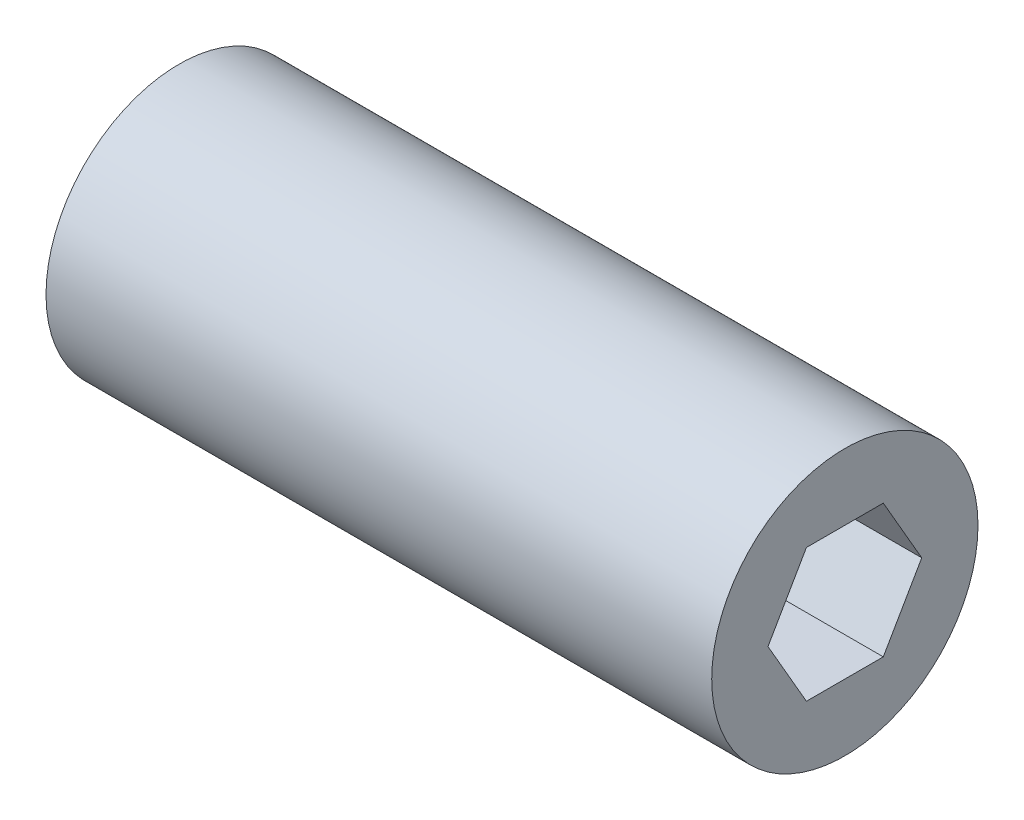
ISO-10303-21;
HEADER;
FILE_DESCRIPTION(('STEP AP214'),'2;1');
FILE_NAME('part.step','',(''),(''),'','','');
FILE_SCHEMA(('AUTOMOTIVE_DESIGN { 1 0 10303 214 1 1 1 1 }'));
ENDSEC;
DATA;
#1=APPLICATION_CONTEXT('core data for automotive mechanical design processes');
#2=APPLICATION_PROTOCOL_DEFINITION('international standard','automotive_design',2000,#1);
#3=PRODUCT_CONTEXT('',#1,'mechanical');
#4=PRODUCT('Part','Part','',(#3));
#5=PRODUCT_RELATED_PRODUCT_CATEGORY('part','',(#4));
#6=PRODUCT_DEFINITION_FORMATION('','',#4);
#7=PRODUCT_DEFINITION_CONTEXT('part definition',#1,'design');
#8=PRODUCT_DEFINITION('design','',#6,#7);
#9=PRODUCT_DEFINITION_SHAPE('','',#8);
#10=(LENGTH_UNIT() NAMED_UNIT(*) SI_UNIT(.MILLI.,.METRE.));
#11=(NAMED_UNIT(*) PLANE_ANGLE_UNIT() SI_UNIT($,.RADIAN.));
#12=(NAMED_UNIT(*) SI_UNIT($,.STERADIAN.) SOLID_ANGLE_UNIT());
#13=UNCERTAINTY_MEASURE_WITH_UNIT(LENGTH_MEASURE(1.E-05),#10,'distance_accuracy_value','');
#14=(GEOMETRIC_REPRESENTATION_CONTEXT(3) GLOBAL_UNCERTAINTY_ASSIGNED_CONTEXT((#13)) GLOBAL_UNIT_ASSIGNED_CONTEXT((#10,
#11,#12)) REPRESENTATION_CONTEXT('',''));
#15=CARTESIAN_POINT('',(0.,0.,0.));
#16=DIRECTION('',(0.,0.,1.));
#17=DIRECTION('',(1.,0.,0.));
#18=AXIS2_PLACEMENT_3D('',#15,#16,#17);
#19=CARTESIAN_POINT('',(8.3,0.,7.));
#20=DIRECTION('',(1.,0.,0.));
#21=DIRECTION('',(0.,0.,-1.));
#22=AXIS2_PLACEMENT_3D('',#19,#20,#21);
#23=PLANE('',#22);
#24=DIRECTION('',(0.,-0.866025404730548,-0.499999998361291));
#25=VECTOR('',#24,1.);
#26=CARTESIAN_POINT('',(8.3,-0.375,7.64951905));
#27=LINE('',#26,#25);
#28=CARTESIAN_POINT('',(8.3,0.,7.8660254));
#29=VERTEX_POINT('',#28);
#30=CARTESIAN_POINT('',(8.3,-0.75,7.4330127));
#31=VERTEX_POINT('',#30);
#32=EDGE_CURVE('E80',#29,#31,#27,.T.);
#33=ORIENTED_EDGE('',*,*,#32,.T.);
#34=DIRECTION('',(0.,0.,-1.));
#35=VECTOR('',#34,1.);
#36=CARTESIAN_POINT('',(8.3,-0.75,7.));
#37=LINE('',#36,#35);
#38=CARTESIAN_POINT('',(8.3,-0.75,6.5669873));
#39=VERTEX_POINT('',#38);
#40=EDGE_CURVE('E64',#31,#39,#37,.T.);
#41=ORIENTED_EDGE('',*,*,#40,.T.);
#42=DIRECTION('',(0.,0.866025404730548,-0.499999998361291));
#43=VECTOR('',#42,1.);
#44=CARTESIAN_POINT('',(8.3,-0.375,6.35048095));
#45=LINE('',#44,#43);
#46=CARTESIAN_POINT('',(8.3,0.,6.1339746));
#47=VERTEX_POINT('',#46);
#48=EDGE_CURVE('E69',#39,#47,#45,.T.);
#49=ORIENTED_EDGE('',*,*,#48,.T.);
#50=DIRECTION('',(0.,0.866025404730548,0.499999998361291));
#51=VECTOR('',#50,1.);
#52=CARTESIAN_POINT('',(8.3,0.375,6.35048095));
#53=LINE('',#52,#51);
#54=CARTESIAN_POINT('',(8.3,0.75,6.5669873));
#55=VERTEX_POINT('',#54);
#56=EDGE_CURVE('E103',#47,#55,#53,.T.);
#57=ORIENTED_EDGE('',*,*,#56,.T.);
#58=DIRECTION('',(0.,0.,1.));
#59=VECTOR('',#58,1.);
#60=CARTESIAN_POINT('',(8.3,0.75,7.));
#61=LINE('',#60,#59);
#62=CARTESIAN_POINT('',(8.3,0.75,7.4330127));
#63=VERTEX_POINT('',#62);
#64=EDGE_CURVE('E98',#55,#63,#61,.T.);
#65=ORIENTED_EDGE('',*,*,#64,.T.);
#66=DIRECTION('',(0.,-0.866025404730548,0.499999998361291));
#67=VECTOR('',#66,1.);
#68=CARTESIAN_POINT('',(8.3,0.375,7.64951905));
#69=LINE('',#68,#67);
#70=EDGE_CURVE('E94',#63,#29,#69,.T.);
#71=ORIENTED_EDGE('',*,*,#70,.T.);
#72=EDGE_LOOP('',(#33,#41,#49,#57,#65,#71));
#73=FACE_BOUND('',#72,.T.);
#74=ADVANCED_FACE('F16',(#73),#23,.T.);
#75=CARTESIAN_POINT('',(10.,-0.375,6.35048095));
#76=DIRECTION('',(0.,-0.499999998361291,-0.866025404730548));
#77=DIRECTION('',(0.,0.866025404730548,-0.499999998361291));
#78=AXIS2_PLACEMENT_3D('',#75,#76,#77);
#79=PLANE('',#78);
#80=DIRECTION('',(1.,0.,0.));
#81=VECTOR('',#80,1.);
#82=CARTESIAN_POINT('',(10.,-0.75,6.5669873));
#83=LINE('',#82,#81);
#84=CARTESIAN_POINT('',(10.,-0.75,6.5669873));
#85=VERTEX_POINT('',#84);
#86=EDGE_CURVE('E71',#39,#85,#83,.T.);
#87=ORIENTED_EDGE('',*,*,#86,.T.);
#88=DIRECTION('',(0.,-0.866025404730548,0.49999999836129));
#89=VECTOR('',#88,1.);
#90=CARTESIAN_POINT('',(10.,0.,6.1339746));
#91=LINE('',#90,#89);
#92=CARTESIAN_POINT('',(10.,0.,6.1339746));
#93=VERTEX_POINT('',#92);
#94=EDGE_CURVE('E105',#93,#85,#91,.T.);
#95=ORIENTED_EDGE('',*,*,#94,.F.);
#96=DIRECTION('',(1.,0.,0.));
#97=VECTOR('',#96,1.);
#98=CARTESIAN_POINT('',(10.,0.,6.1339746));
#99=LINE('',#98,#97);
#100=EDGE_CURVE('E74',#93,#47,#99,.F.);
#101=ORIENTED_EDGE('',*,*,#100,.T.);
#102=ORIENTED_EDGE('',*,*,#48,.F.);
#103=EDGE_LOOP('',(#87,#95,#101,#102));
#104=FACE_BOUND('',#103,.T.);
#105=ADVANCED_FACE('F70',(#104),#79,.F.);
#106=CARTESIAN_POINT('',(10.,-0.75,7.));
#107=DIRECTION('',(0.,-1.,0.));
#108=DIRECTION('',(0.,0.,-1.));
#109=AXIS2_PLACEMENT_3D('',#106,#107,#108);
#110=PLANE('',#109);
#111=DIRECTION('',(1.,0.,0.));
#112=VECTOR('',#111,1.);
#113=CARTESIAN_POINT('',(10.,-0.75,7.4330127));
#114=LINE('',#113,#112);
#115=CARTESIAN_POINT('',(10.,-0.75,7.4330127));
#116=VERTEX_POINT('',#115);
#117=EDGE_CURVE('E82',#31,#116,#114,.T.);
#118=ORIENTED_EDGE('',*,*,#117,.T.);
#119=DIRECTION('',(0.,0.,-1.));
#120=VECTOR('',#119,1.);
#121=CARTESIAN_POINT('',(10.,-0.75,6.25));
#122=LINE('',#121,#120);
#123=EDGE_CURVE('E86',#85,#116,#122,.F.);
#124=ORIENTED_EDGE('',*,*,#123,.F.);
#125=ORIENTED_EDGE('',*,*,#86,.F.);
#126=ORIENTED_EDGE('',*,*,#40,.F.);
#127=EDGE_LOOP('',(#118,#124,#125,#126));
#128=FACE_BOUND('',#127,.T.);
#129=ADVANCED_FACE('F84',(#128),#110,.F.);
#130=CARTESIAN_POINT('',(10.,-0.375,7.64951905));
#131=DIRECTION('',(0.,-0.499999998361291,0.866025404730548));
#132=DIRECTION('',(0.,-0.866025404730548,-0.499999998361291));
#133=AXIS2_PLACEMENT_3D('',#130,#131,#132);
#134=PLANE('',#133);
#135=DIRECTION('',(1.,0.,0.));
#136=VECTOR('',#135,1.);
#137=CARTESIAN_POINT('',(10.,0.,7.8660254));
#138=LINE('',#137,#136);
#139=CARTESIAN_POINT('',(10.,0.,7.8660254));
#140=VERTEX_POINT('',#139);
#141=EDGE_CURVE('E92',#29,#140,#138,.T.);
#142=ORIENTED_EDGE('',*,*,#141,.T.);
#143=DIRECTION('',(0.,0.866025404730548,0.499999998361291));
#144=VECTOR('',#143,1.);
#145=CARTESIAN_POINT('',(10.,-0.75,7.4330127));
#146=LINE('',#145,#144);
#147=EDGE_CURVE('E108',#116,#140,#146,.T.);
#148=ORIENTED_EDGE('',*,*,#147,.F.);
#149=ORIENTED_EDGE('',*,*,#117,.F.);
#150=ORIENTED_EDGE('',*,*,#32,.F.);
#151=EDGE_LOOP('',(#142,#148,#149,#150));
#152=FACE_BOUND('',#151,.T.);
#153=ADVANCED_FACE('F195',(#152),#134,.F.);
#154=CARTESIAN_POINT('',(10.,0.375,7.64951905));
#155=DIRECTION('',(0.,0.499999998361291,0.866025404730548));
#156=DIRECTION('',(0.,-0.866025404730548,0.499999998361291));
#157=AXIS2_PLACEMENT_3D('',#154,#155,#156);
#158=PLANE('',#157);
#159=DIRECTION('',(1.,0.,0.));
#160=VECTOR('',#159,1.);
#161=CARTESIAN_POINT('',(10.,0.75,7.4330127));
#162=LINE('',#161,#160);
#163=CARTESIAN_POINT('',(10.,0.75,7.4330127));
#164=VERTEX_POINT('',#163);
#165=EDGE_CURVE('E96',#63,#164,#162,.T.);
#166=ORIENTED_EDGE('',*,*,#165,.T.);
#167=DIRECTION('',(0.,0.866025404730548,-0.499999998361291));
#168=VECTOR('',#167,1.);
#169=CARTESIAN_POINT('',(10.,0.,7.8660254));
#170=LINE('',#169,#168);
#171=EDGE_CURVE('E111',#140,#164,#170,.T.);
#172=ORIENTED_EDGE('',*,*,#171,.F.);
#173=ORIENTED_EDGE('',*,*,#141,.F.);
#174=ORIENTED_EDGE('',*,*,#70,.F.);
#175=EDGE_LOOP('',(#166,#172,#173,#174));
#176=FACE_BOUND('',#175,.T.);
#177=ADVANCED_FACE('F183',(#176),#158,.F.);
#178=CARTESIAN_POINT('',(10.,0.75,7.));
#179=DIRECTION('',(0.,1.,0.));
#180=DIRECTION('',(0.,0.,1.));
#181=AXIS2_PLACEMENT_3D('',#178,#179,#180);
#182=PLANE('',#181);
#183=DIRECTION('',(1.,0.,0.));
#184=VECTOR('',#183,1.);
#185=CARTESIAN_POINT('',(10.,0.75,6.5669873));
#186=LINE('',#185,#184);
#187=CARTESIAN_POINT('',(10.,0.75,6.5669873));
#188=VERTEX_POINT('',#187);
#189=EDGE_CURVE('E32',#55,#188,#186,.T.);
#190=ORIENTED_EDGE('',*,*,#189,.T.);
#191=DIRECTION('',(0.,0.,-1.));
#192=VECTOR('',#191,1.);
#193=CARTESIAN_POINT('',(10.,0.75,6.25));
#194=LINE('',#193,#192);
#195=EDGE_CURVE('E114',#164,#188,#194,.T.);
#196=ORIENTED_EDGE('',*,*,#195,.F.);
#197=ORIENTED_EDGE('',*,*,#165,.F.);
#198=ORIENTED_EDGE('',*,*,#64,.F.);
#199=EDGE_LOOP('',(#190,#196,#197,#198));
#200=FACE_BOUND('',#199,.T.);
#201=ADVANCED_FACE('F139',(#200),#182,.F.);
#202=CARTESIAN_POINT('',(10.,0.375,6.35048095));
#203=DIRECTION('',(0.,0.499999998361291,-0.866025404730548));
#204=DIRECTION('',(0.,0.866025404730548,0.499999998361291));
#205=AXIS2_PLACEMENT_3D('',#202,#203,#204);
#206=PLANE('',#205);
#207=ORIENTED_EDGE('',*,*,#100,.F.);
#208=DIRECTION('',(0.,-0.866025404730548,-0.49999999836129));
#209=VECTOR('',#208,1.);
#210=CARTESIAN_POINT('',(10.,0.75,6.5669873));
#211=LINE('',#210,#209);
#212=EDGE_CURVE('E117',#188,#93,#211,.T.);
#213=ORIENTED_EDGE('',*,*,#212,.F.);
#214=ORIENTED_EDGE('',*,*,#189,.F.);
#215=ORIENTED_EDGE('',*,*,#56,.F.);
#216=EDGE_LOOP('',(#207,#213,#214,#215));
#217=FACE_BOUND('',#216,.T.);
#218=ADVANCED_FACE('F129',(#217),#206,.F.);
#219=CARTESIAN_POINT('',(2.5,0.,6.25));
#220=DIRECTION('',(-1.,0.,0.));
#221=DIRECTION('',(0.,0.,1.));
#222=AXIS2_PLACEMENT_3D('',#219,#220,#221);
#223=PLANE('',#222);
#224=CARTESIAN_POINT('',(2.5,0.,7.));
#225=DIRECTION('',(1.,0.,0.));
#226=DIRECTION('',(0.,0.,-1.));
#227=AXIS2_PLACEMENT_3D('',#224,#225,#226);
#228=CIRCLE('',#227,1.5);
#229=CARTESIAN_POINT('',(2.5,0.,5.5));
#230=VERTEX_POINT('',#229);
#231=EDGE_CURVE('E19',#230,#230,#228,.T.);
#232=ORIENTED_EDGE('',*,*,#231,.F.);
#233=EDGE_LOOP('',(#232));
#234=FACE_BOUND('',#233,.T.);
#235=ADVANCED_FACE('F126',(#234),#223,.T.);
#236=CARTESIAN_POINT('',(10.,0.,6.25));
#237=DIRECTION('',(1.,0.,0.));
#238=DIRECTION('',(0.,0.,-1.));
#239=AXIS2_PLACEMENT_3D('',#236,#237,#238);
#240=PLANE('',#239);
#241=CARTESIAN_POINT('',(10.,0.,7.));
#242=DIRECTION('',(1.,0.,0.));
#243=DIRECTION('',(0.,0.,-1.));
#244=AXIS2_PLACEMENT_3D('',#241,#242,#243);
#245=CIRCLE('',#244,1.5);
#246=CARTESIAN_POINT('',(10.,0.,5.5));
#247=VERTEX_POINT('',#246);
#248=EDGE_CURVE('E11',#247,#247,#245,.F.);
#249=ORIENTED_EDGE('',*,*,#248,.F.);
#250=EDGE_LOOP('',(#249));
#251=FACE_BOUND('',#250,.T.);
#252=ORIENTED_EDGE('',*,*,#195,.T.);
#253=ORIENTED_EDGE('',*,*,#212,.T.);
#254=ORIENTED_EDGE('',*,*,#94,.T.);
#255=ORIENTED_EDGE('',*,*,#123,.T.);
#256=ORIENTED_EDGE('',*,*,#147,.T.);
#257=ORIENTED_EDGE('',*,*,#171,.T.);
#258=EDGE_LOOP('',(#252,#253,#254,#255,#256,#257));
#259=FACE_BOUND('',#258,.T.);
#260=ADVANCED_FACE('F128',(#251,#259),#240,.T.);
#261=CARTESIAN_POINT('',(6.25,0.,7.));
#262=DIRECTION('',(1.,0.,0.));
#263=DIRECTION('',(0.,0.,-1.));
#264=AXIS2_PLACEMENT_3D('',#261,#262,#263);
#265=CYLINDRICAL_SURFACE('',#264,1.5);
#266=ORIENTED_EDGE('',*,*,#231,.T.);
#267=EDGE_LOOP('',(#266));
#268=FACE_BOUND('',#267,.T.);
#269=ORIENTED_EDGE('',*,*,#248,.T.);
#270=EDGE_LOOP('',(#269));
#271=FACE_BOUND('',#270,.T.);
#272=ADVANCED_FACE('F123',(#268,#271),#265,.T.);
#273=CLOSED_SHELL('',(#74,#105,#129,#153,#177,#201,#218,#235,#260,#272));
#274=MANIFOLD_SOLID_BREP('B1',#273);
#275=ADVANCED_BREP_SHAPE_REPRESENTATION('',(#18,#274),#14);
#276=SHAPE_DEFINITION_REPRESENTATION(#9,#275);
ENDSEC;
END-ISO-10303-21;
